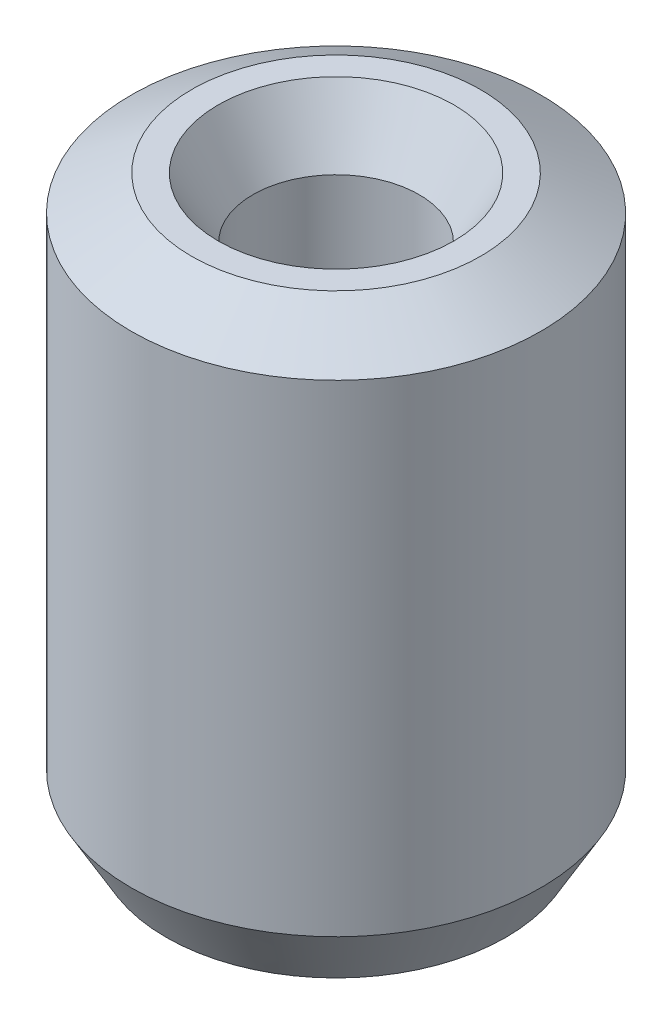
ISO-10303-21;
HEADER;
FILE_DESCRIPTION(('STEP AP214'),'2;1');
FILE_NAME('part.step','',(''),(''),'','','');
FILE_SCHEMA(('AUTOMOTIVE_DESIGN { 1 0 10303 214 1 1 1 1 }'));
ENDSEC;
DATA;
#1=APPLICATION_CONTEXT('core data for automotive mechanical design processes');
#2=APPLICATION_PROTOCOL_DEFINITION('international standard','automotive_design',2000,#1);
#3=PRODUCT_CONTEXT('',#1,'mechanical');
#4=PRODUCT('Part','Part','',(#3));
#5=PRODUCT_RELATED_PRODUCT_CATEGORY('part','',(#4));
#6=PRODUCT_DEFINITION_FORMATION('','',#4);
#7=PRODUCT_DEFINITION_CONTEXT('part definition',#1,'design');
#8=PRODUCT_DEFINITION('design','',#6,#7);
#9=PRODUCT_DEFINITION_SHAPE('','',#8);
#10=(LENGTH_UNIT() NAMED_UNIT(*) SI_UNIT(.MILLI.,.METRE.));
#11=(NAMED_UNIT(*) PLANE_ANGLE_UNIT() SI_UNIT($,.RADIAN.));
#12=(NAMED_UNIT(*) SI_UNIT($,.STERADIAN.) SOLID_ANGLE_UNIT());
#13=UNCERTAINTY_MEASURE_WITH_UNIT(LENGTH_MEASURE(1.E-05),#10,'distance_accuracy_value','');
#14=(GEOMETRIC_REPRESENTATION_CONTEXT(3) GLOBAL_UNCERTAINTY_ASSIGNED_CONTEXT((#13)) GLOBAL_UNIT_ASSIGNED_CONTEXT((#10,
#11,#12)) REPRESENTATION_CONTEXT('',''));
#15=CARTESIAN_POINT('',(0.,0.,0.));
#16=DIRECTION('',(0.,0.,1.));
#17=DIRECTION('',(1.,0.,0.));
#18=AXIS2_PLACEMENT_3D('',#15,#16,#17);
#19=CARTESIAN_POINT('',(0.,49.3151112697286,0.));
#20=DIRECTION('',(0.,-1.,0.));
#21=DIRECTION('',(0.,0.,-1.));
#22=AXIS2_PLACEMENT_3D('',#19,#20,#21);
#23=CYLINDRICAL_SURFACE('',#22,17.5);
#24=CARTESIAN_POINT('',(0.,5.15352760739814,0.));
#25=DIRECTION('',(0.,1.,0.));
#26=DIRECTION('',(0.,0.,1.));
#27=AXIS2_PLACEMENT_3D('',#24,#25,#26);
#28=CIRCLE('',#27,17.5);
#29=CARTESIAN_POINT('',(0.,5.15352760739814,17.5));
#30=VERTEX_POINT('',#29);
#31=EDGE_CURVE('E10',#30,#30,#28,.T.);
#32=ORIENTED_EDGE('',*,*,#31,.T.);
#33=EDGE_LOOP('',(#32));
#34=FACE_BOUND('',#33,.T.);
#35=CARTESIAN_POINT('',(0.,46.3397207183211,0.));
#36=DIRECTION('',(0.,1.,0.));
#37=DIRECTION('',(0.,0.,1.));
#38=AXIS2_PLACEMENT_3D('',#35,#36,#37);
#39=CIRCLE('',#38,17.5);
#40=CARTESIAN_POINT('',(0.,46.3397207183211,17.5));
#41=VERTEX_POINT('',#40);
#42=EDGE_CURVE('E50',#41,#41,#39,.F.);
#43=ORIENTED_EDGE('',*,*,#42,.T.);
#44=EDGE_LOOP('',(#43));
#45=FACE_BOUND('',#44,.T.);
#46=ADVANCED_FACE('F39',(#34,#45),#23,.T.);
#47=CARTESIAN_POINT('',(0.,49.3151112697286,0.));
#48=DIRECTION('',(0.,1.,0.));
#49=DIRECTION('',(0.,0.,1.));
#50=AXIS2_PLACEMENT_3D('',#47,#48,#49);
#51=PLANE('',#50);
#52=CARTESIAN_POINT('',(0.,49.3151112697286,0.));
#53=DIRECTION('',(0.,1.,0.));
#54=DIRECTION('',(0.,0.,1.));
#55=AXIS2_PLACEMENT_3D('',#52,#53,#54);
#56=CIRCLE('',#55,10.0764079269506);
#57=CARTESIAN_POINT('',(0.,49.3151112697286,10.0764079269506));
#58=VERTEX_POINT('',#57);
#59=EDGE_CURVE('E58',#58,#58,#56,.F.);
#60=ORIENTED_EDGE('',*,*,#59,.T.);
#61=EDGE_LOOP('',(#60));
#62=FACE_BOUND('',#61,.T.);
#63=CARTESIAN_POINT('',(0.,49.3151112697286,0.));
#64=DIRECTION('',(0.,1.,0.));
#65=DIRECTION('',(0.,0.,1.));
#66=AXIS2_PLACEMENT_3D('',#63,#64,#65);
#67=CIRCLE('',#66,12.3464723926019);
#68=CARTESIAN_POINT('',(0.,49.3151112697286,12.3464723926019));
#69=VERTEX_POINT('',#68);
#70=EDGE_CURVE('E61',#69,#69,#67,.T.);
#71=ORIENTED_EDGE('',*,*,#70,.T.);
#72=EDGE_LOOP('',(#71));
#73=FACE_BOUND('',#72,.T.);
#74=ADVANCED_FACE('F88',(#62,#73),#51,.T.);
#75=CARTESIAN_POINT('',(0.,0.,0.));
#76=DIRECTION('',(0.,1.,0.));
#77=DIRECTION('',(0.,0.,1.));
#78=AXIS2_PLACEMENT_3D('',#75,#76,#77);
#79=PLANE('',#78);
#80=CARTESIAN_POINT('',(0.,0.,0.));
#81=DIRECTION('',(0.,1.,0.));
#82=DIRECTION('',(0.,0.,1.));
#83=AXIS2_PLACEMENT_3D('',#80,#81,#82);
#84=CIRCLE('',#83,12.2545449829413);
#85=CARTESIAN_POINT('',(0.,0.,12.2545449829413));
#86=VERTEX_POINT('',#85);
#87=EDGE_CURVE('E51',#86,#86,#84,.T.);
#88=ORIENTED_EDGE('',*,*,#87,.T.);
#89=EDGE_LOOP('',(#88));
#90=FACE_BOUND('',#89,.T.);
#91=CARTESIAN_POINT('',(0.,0.,0.));
#92=DIRECTION('',(0.,1.,0.));
#93=DIRECTION('',(0.,0.,1.));
#94=AXIS2_PLACEMENT_3D('',#91,#92,#93);
#95=CIRCLE('',#94,14.5246094485925);
#96=CARTESIAN_POINT('',(0.,0.,14.5246094485925));
#97=VERTEX_POINT('',#96);
#98=EDGE_CURVE('E54',#97,#97,#95,.F.);
#99=ORIENTED_EDGE('',*,*,#98,.T.);
#100=EDGE_LOOP('',(#99));
#101=FACE_BOUND('',#100,.T.);
#102=ADVANCED_FACE('F83',(#90,#101),#79,.F.);
#103=CARTESIAN_POINT('',(0.,49.3151112697286,0.));
#104=DIRECTION('',(0.,-1.,0.));
#105=DIRECTION('',(0.,0.,-1.));
#106=AXIS2_PLACEMENT_3D('',#103,#104,#105);
#107=CYLINDRICAL_SURFACE('',#106,7.10101737554311);
#108=CARTESIAN_POINT('',(0.,44.1615836623305,0.));
#109=DIRECTION('',(0.,1.,0.));
#110=DIRECTION('',(0.,0.,1.));
#111=AXIS2_PLACEMENT_3D('',#108,#109,#110);
#112=CIRCLE('',#111,7.10101737554311);
#113=CARTESIAN_POINT('',(0.,44.1615836623305,7.10101737554311));
#114=VERTEX_POINT('',#113);
#115=EDGE_CURVE('E67',#114,#114,#112,.T.);
#116=ORIENTED_EDGE('',*,*,#115,.T.);
#117=EDGE_LOOP('',(#116));
#118=FACE_BOUND('',#117,.T.);
#119=CARTESIAN_POINT('',(0.,2.97539055140751,0.));
#120=DIRECTION('',(0.,1.,0.));
#121=DIRECTION('',(0.,0.,1.));
#122=AXIS2_PLACEMENT_3D('',#119,#120,#121);
#123=CIRCLE('',#122,7.10101737554311);
#124=CARTESIAN_POINT('',(0.,2.97539055140751,7.10101737554311));
#125=VERTEX_POINT('',#124);
#126=EDGE_CURVE('E69',#125,#125,#123,.F.);
#127=ORIENTED_EDGE('',*,*,#126,.T.);
#128=EDGE_LOOP('',(#127));
#129=FACE_BOUND('',#128,.T.);
#130=ADVANCED_FACE('F71',(#118,#129),#107,.F.);
#131=CARTESIAN_POINT('',(0.,44.1615836623305,0.));
#132=DIRECTION('',(0.,1.,0.));
#133=DIRECTION('',(0.,0.,1.));
#134=AXIS2_PLACEMENT_3D('',#131,#132,#133);
#135=CONICAL_SURFACE('',#134,7.10101737554311,0.523598775598302);
#136=ORIENTED_EDGE('',*,*,#59,.F.);
#137=EDGE_LOOP('',(#136));
#138=FACE_BOUND('',#137,.T.);
#139=ORIENTED_EDGE('',*,*,#115,.F.);
#140=EDGE_LOOP('',(#139));
#141=FACE_BOUND('',#140,.T.);
#142=ADVANCED_FACE('F77',(#138,#141),#135,.F.);
#143=CARTESIAN_POINT('',(0.,0.,0.));
#144=DIRECTION('',(0.,-1.,0.));
#145=DIRECTION('',(0.,0.,-1.));
#146=AXIS2_PLACEMENT_3D('',#143,#144,#145);
#147=CONICAL_SURFACE('',#146,12.2545449829413,1.04719755119659);
#148=ORIENTED_EDGE('',*,*,#126,.F.);
#149=EDGE_LOOP('',(#148));
#150=FACE_BOUND('',#149,.T.);
#151=ORIENTED_EDGE('',*,*,#87,.F.);
#152=EDGE_LOOP('',(#151));
#153=FACE_BOUND('',#152,.T.);
#154=ADVANCED_FACE('F73',(#150,#153),#147,.F.);
#155=CARTESIAN_POINT('',(0.,5.15352760739814,0.));
#156=DIRECTION('',(0.,1.,0.));
#157=DIRECTION('',(0.,0.,1.));
#158=AXIS2_PLACEMENT_3D('',#155,#156,#157);
#159=CONICAL_SURFACE('',#158,17.5,0.523598775598303);
#160=ORIENTED_EDGE('',*,*,#98,.F.);
#161=EDGE_LOOP('',(#160));
#162=FACE_BOUND('',#161,.T.);
#163=ORIENTED_EDGE('',*,*,#31,.F.);
#164=EDGE_LOOP('',(#163));
#165=FACE_BOUND('',#164,.T.);
#166=ADVANCED_FACE('F76',(#162,#165),#159,.T.);
#167=CARTESIAN_POINT('',(0.,49.3151112697286,0.));
#168=DIRECTION('',(0.,-1.,0.));
#169=DIRECTION('',(0.,0.,-1.));
#170=AXIS2_PLACEMENT_3D('',#167,#168,#169);
#171=CONICAL_SURFACE('',#170,12.3464723926019,1.04719755119659);
#172=ORIENTED_EDGE('',*,*,#42,.F.);
#173=EDGE_LOOP('',(#172));
#174=FACE_BOUND('',#173,.T.);
#175=ORIENTED_EDGE('',*,*,#70,.F.);
#176=EDGE_LOOP('',(#175));
#177=FACE_BOUND('',#176,.T.);
#178=ADVANCED_FACE('F45',(#174,#177),#171,.T.);
#179=CLOSED_SHELL('',(#46,#74,#102,#130,#142,#154,#166,#178));
#180=MANIFOLD_SOLID_BREP('B2',#179);
#181=ADVANCED_BREP_SHAPE_REPRESENTATION('',(#18,#180),#14);
#182=SHAPE_DEFINITION_REPRESENTATION(#9,#181);
ENDSEC;
END-ISO-10303-21;
